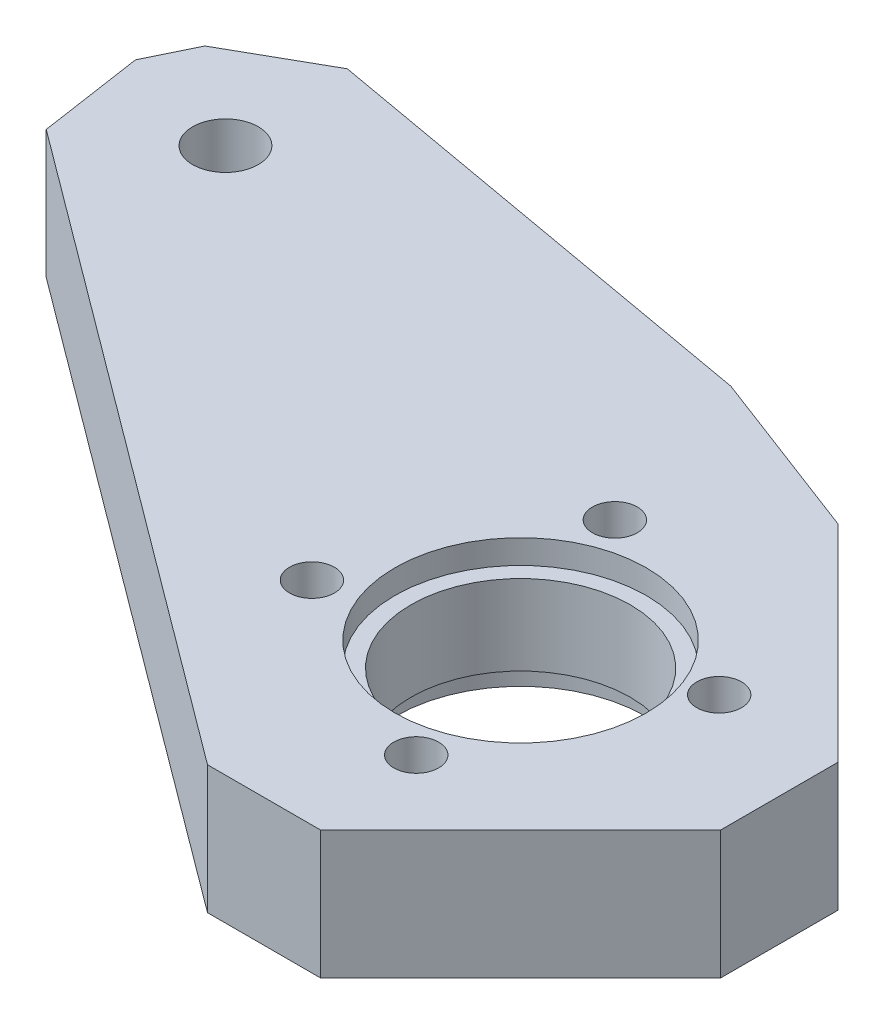
ISO-10303-21;
HEADER;
FILE_DESCRIPTION(('STEP AP214'),'2;1');
FILE_NAME('part.step','',(''),(''),'','','');
FILE_SCHEMA(('AUTOMOTIVE_DESIGN { 1 0 10303 214 1 1 1 1 }'));
ENDSEC;
DATA;
#1=APPLICATION_CONTEXT('core data for automotive mechanical design processes');
#2=APPLICATION_PROTOCOL_DEFINITION('international standard','automotive_design',2000,#1);
#3=PRODUCT_CONTEXT('',#1,'mechanical');
#4=PRODUCT('Part','Part','',(#3));
#5=PRODUCT_RELATED_PRODUCT_CATEGORY('part','',(#4));
#6=PRODUCT_DEFINITION_FORMATION('','',#4);
#7=PRODUCT_DEFINITION_CONTEXT('part definition',#1,'design');
#8=PRODUCT_DEFINITION('design','',#6,#7);
#9=PRODUCT_DEFINITION_SHAPE('','',#8);
#10=(LENGTH_UNIT() NAMED_UNIT(*) SI_UNIT(.MILLI.,.METRE.));
#11=(NAMED_UNIT(*) PLANE_ANGLE_UNIT() SI_UNIT($,.RADIAN.));
#12=(NAMED_UNIT(*) SI_UNIT($,.STERADIAN.) SOLID_ANGLE_UNIT());
#13=UNCERTAINTY_MEASURE_WITH_UNIT(LENGTH_MEASURE(1.E-05),#10,'distance_accuracy_value','');
#14=(GEOMETRIC_REPRESENTATION_CONTEXT(3) GLOBAL_UNCERTAINTY_ASSIGNED_CONTEXT((#13)) GLOBAL_UNIT_ASSIGNED_CONTEXT((#10,
#11,#12)) REPRESENTATION_CONTEXT('',''));
#15=CARTESIAN_POINT('',(0.,0.,0.));
#16=DIRECTION('',(0.,0.,1.));
#17=DIRECTION('',(1.,0.,0.));
#18=AXIS2_PLACEMENT_3D('',#15,#16,#17);
#19=CARTESIAN_POINT('',(-206.266697519,-37.000004703,299.965154128));
#20=DIRECTION('',(0.,-1.,0.));
#21=DIRECTION('',(0.,0.,-1.));
#22=AXIS2_PLACEMENT_3D('',#19,#20,#21);
#23=PLANE('',#22);
#24=CARTESIAN_POINT('',(100.000038384,-37.000004703,62.5));
#25=DIRECTION('',(0.,-1.,0.));
#26=DIRECTION('',(0.,0.,-1.));
#27=AXIS2_PLACEMENT_3D('',#24,#25,#26);
#28=CIRCLE('',#27,6.85);
#29=CARTESIAN_POINT('',(100.000038384,-37.000004703,55.65));
#30=VERTEX_POINT('',#29);
#31=CARTESIAN_POINT('',(93.150038384,-37.000004703,62.5));
#32=VERTEX_POINT('',#31);
#33=EDGE_CURVE('E342',#30,#32,#28,.T.);
#34=ORIENTED_EDGE('',*,*,#33,.T.);
#35=CARTESIAN_POINT('',(100.000038384,-37.000004703,62.5));
#36=DIRECTION('',(0.,-1.,0.));
#37=DIRECTION('',(0.,0.,-1.));
#38=AXIS2_PLACEMENT_3D('',#35,#36,#37);
#39=CIRCLE('',#38,6.85);
#40=EDGE_CURVE('E169',#32,#30,#39,.T.);
#41=ORIENTED_EDGE('',*,*,#40,.T.);
#42=EDGE_LOOP('',(#34,#41));
#43=FACE_BOUND('',#42,.T.);
#44=CARTESIAN_POINT('',(100.000038384,-37.000004703,62.5));
#45=DIRECTION('',(0.,-1.,0.));
#46=DIRECTION('',(0.,0.,-1.));
#47=AXIS2_PLACEMENT_3D('',#44,#45,#46);
#48=CIRCLE('',#47,7.85);
#49=CARTESIAN_POINT('',(92.150038384,-37.000004703,62.5));
#50=VERTEX_POINT('',#49);
#51=CARTESIAN_POINT('',(100.000038384,-37.000004703,54.65));
#52=VERTEX_POINT('',#51);
#53=EDGE_CURVE('E355',#50,#52,#48,.T.);
#54=ORIENTED_EDGE('',*,*,#53,.F.);
#55=CARTESIAN_POINT('',(100.000038384,-37.000004703,62.5));
#56=DIRECTION('',(0.,-1.,0.));
#57=DIRECTION('',(0.,0.,-1.));
#58=AXIS2_PLACEMENT_3D('',#55,#56,#57);
#59=CIRCLE('',#58,7.85);
#60=EDGE_CURVE('E352',#52,#50,#59,.T.);
#61=ORIENTED_EDGE('',*,*,#60,.F.);
#62=EDGE_LOOP('',(#54,#61));
#63=FACE_BOUND('',#62,.T.);
#64=ADVANCED_FACE('F92',(#43,#63),#23,.F.);
#65=CARTESIAN_POINT('',(-206.266697519,-42.000004703,299.965154128));
#66=DIRECTION('',(0.,-1.,0.));
#67=DIRECTION('',(0.,0.,-1.));
#68=AXIS2_PLACEMENT_3D('',#65,#66,#67);
#69=PLANE('',#68);
#70=CARTESIAN_POINT('',(100.000038384,-42.000004703,62.5));
#71=DIRECTION('',(0.,-1.,0.));
#72=DIRECTION('',(0.,0.,-1.));
#73=AXIS2_PLACEMENT_3D('',#70,#71,#72);
#74=CIRCLE('',#73,6.85);
#75=CARTESIAN_POINT('',(93.150038384,-42.000004703,62.5));
#76=VERTEX_POINT('',#75);
#77=CARTESIAN_POINT('',(100.000038384,-42.000004703,55.65));
#78=VERTEX_POINT('',#77);
#79=EDGE_CURVE('E96',#76,#78,#74,.T.);
#80=ORIENTED_EDGE('',*,*,#79,.F.);
#81=CARTESIAN_POINT('',(100.000038384,-42.000004703,62.5));
#82=DIRECTION('',(0.,-1.,0.));
#83=DIRECTION('',(0.,0.,-1.));
#84=AXIS2_PLACEMENT_3D('',#81,#82,#83);
#85=CIRCLE('',#84,6.85);
#86=EDGE_CURVE('E12',#78,#76,#85,.T.);
#87=ORIENTED_EDGE('',*,*,#86,.F.);
#88=EDGE_LOOP('',(#80,#87));
#89=FACE_BOUND('',#88,.T.);
#90=CARTESIAN_POINT('',(100.000038384,-42.000004703,62.5));
#91=DIRECTION('',(0.,-1.,0.));
#92=DIRECTION('',(0.,0.,-1.));
#93=AXIS2_PLACEMENT_3D('',#90,#91,#92);
#94=CIRCLE('',#93,7.8);
#95=CARTESIAN_POINT('',(100.000038384,-42.000004703,54.7));
#96=VERTEX_POINT('',#95);
#97=CARTESIAN_POINT('',(92.200038384,-42.000004703,62.5));
#98=VERTEX_POINT('',#97);
#99=EDGE_CURVE('E364',#96,#98,#94,.T.);
#100=ORIENTED_EDGE('',*,*,#99,.T.);
#101=CARTESIAN_POINT('',(100.000038384,-42.000004703,62.5));
#102=DIRECTION('',(0.,-1.,0.));
#103=DIRECTION('',(0.,0.,-1.));
#104=AXIS2_PLACEMENT_3D('',#101,#102,#103);
#105=CIRCLE('',#104,7.8);
#106=EDGE_CURVE('E362',#98,#96,#105,.T.);
#107=ORIENTED_EDGE('',*,*,#106,.T.);
#108=EDGE_LOOP('',(#100,#107));
#109=FACE_BOUND('',#108,.T.);
#110=ADVANCED_FACE('F452',(#89,#109),#69,.T.);
#111=CARTESIAN_POINT('',(100.000038384,-40.500004703,62.5));
#112=DIRECTION('',(0.,1.,0.));
#113=DIRECTION('',(-1.,0.,0.));
#114=AXIS2_PLACEMENT_3D('',#111,#112,#113);
#115=CYLINDRICAL_SURFACE('',#114,6.85);
#116=DIRECTION('',(0.,-1.,0.));
#117=VECTOR('',#116,1.);
#118=CARTESIAN_POINT('',(93.150038384,-37.000004703,62.5));
#119=LINE('',#118,#117);
#120=EDGE_CURVE('E344',#32,#76,#119,.T.);
#121=ORIENTED_EDGE('',*,*,#120,.F.);
#122=ORIENTED_EDGE('',*,*,#33,.F.);
#123=ORIENTED_EDGE('',*,*,#40,.F.);
#124=ORIENTED_EDGE('',*,*,#120,.T.);
#125=ORIENTED_EDGE('',*,*,#79,.T.);
#126=ORIENTED_EDGE('',*,*,#86,.T.);
#127=EDGE_LOOP('',(#121,#122,#123,#124,#125,#126));
#128=FACE_BOUND('',#127,.T.);
#129=ADVANCED_FACE('F454',(#128),#115,.F.);
#130=CARTESIAN_POINT('',(-206.266697519,-35.500004703,299.965154128));
#131=DIRECTION('',(0.,-1.,0.));
#132=DIRECTION('',(0.,0.,-1.));
#133=AXIS2_PLACEMENT_3D('',#130,#131,#132);
#134=PLANE('',#133);
#135=CARTESIAN_POINT('',(96.429382788,-35.500004703,53.044814244));
#136=DIRECTION('',(0.,-1.,0.));
#137=DIRECTION('',(1.,0.,0.));
#138=AXIS2_PLACEMENT_3D('',#135,#136,#137);
#139=CIRCLE('',#138,1.4);
#140=CARTESIAN_POINT('',(97.829382788,-35.500004703,53.044814244));
#141=VERTEX_POINT('',#140);
#142=CARTESIAN_POINT('',(95.029382788,-35.500004703,53.044814244));
#143=VERTEX_POINT('',#142);
#144=EDGE_CURVE('E348',#141,#143,#139,.T.);
#145=ORIENTED_EDGE('',*,*,#144,.T.);
#146=CARTESIAN_POINT('',(96.429382788,-35.500004703,53.044814244));
#147=DIRECTION('',(0.,-1.,0.));
#148=DIRECTION('',(1.,0.,0.));
#149=AXIS2_PLACEMENT_3D('',#146,#147,#148);
#150=CIRCLE('',#149,1.4);
#151=EDGE_CURVE('E351',#143,#141,#150,.T.);
#152=ORIENTED_EDGE('',*,*,#151,.T.);
#153=EDGE_LOOP('',(#145,#152));
#154=FACE_BOUND('',#153,.T.);
#155=CARTESIAN_POINT('',(102.940745878,-35.500004703,71.955185756));
#156=DIRECTION('',(0.,-1.,0.));
#157=DIRECTION('',(1.,0.,0.));
#158=AXIS2_PLACEMENT_3D('',#155,#156,#157);
#159=CIRCLE('',#158,1.4);
#160=CARTESIAN_POINT('',(104.340745878,-35.500004703,71.955185756));
#161=VERTEX_POINT('',#160);
#162=CARTESIAN_POINT('',(101.540745878,-35.500004703,71.955185756));
#163=VERTEX_POINT('',#162);
#164=EDGE_CURVE('E361',#161,#163,#159,.T.);
#165=ORIENTED_EDGE('',*,*,#164,.T.);
#166=CARTESIAN_POINT('',(102.940745878,-35.500004703,71.955185756));
#167=DIRECTION('',(0.,-1.,0.));
#168=DIRECTION('',(1.,0.,0.));
#169=AXIS2_PLACEMENT_3D('',#166,#167,#168);
#170=CIRCLE('',#169,1.4);
#171=EDGE_CURVE('E418',#163,#161,#170,.T.);
#172=ORIENTED_EDGE('',*,*,#171,.T.);
#173=EDGE_LOOP('',(#165,#172));
#174=FACE_BOUND('',#173,.T.);
#175=CARTESIAN_POINT('',(90.229878577,-35.500004703,65.755681545));
#176=DIRECTION('',(0.,-1.,0.));
#177=DIRECTION('',(1.,0.,0.));
#178=AXIS2_PLACEMENT_3D('',#175,#176,#177);
#179=CIRCLE('',#178,1.4);
#180=CARTESIAN_POINT('',(91.629878577,-35.500004703,65.755681545));
#181=VERTEX_POINT('',#180);
#182=CARTESIAN_POINT('',(88.829878577,-35.500004703,65.755681545));
#183=VERTEX_POINT('',#182);
#184=EDGE_CURVE('E365',#181,#183,#179,.T.);
#185=ORIENTED_EDGE('',*,*,#184,.T.);
#186=CARTESIAN_POINT('',(90.229878577,-35.500004703,65.755681545));
#187=DIRECTION('',(0.,-1.,0.));
#188=DIRECTION('',(1.,0.,0.));
#189=AXIS2_PLACEMENT_3D('',#186,#187,#188);
#190=CIRCLE('',#189,1.4);
#191=EDGE_CURVE('E340',#183,#181,#190,.T.);
#192=ORIENTED_EDGE('',*,*,#191,.T.);
#193=EDGE_LOOP('',(#185,#192));
#194=FACE_BOUND('',#193,.T.);
#195=CARTESIAN_POINT('',(64.046053168,-35.500004703,44.969712702));
#196=DIRECTION('',(0.,-1.,0.));
#197=DIRECTION('',(0.,0.,-1.));
#198=AXIS2_PLACEMENT_3D('',#195,#196,#197);
#199=CIRCLE('',#198,2.05);
#200=CARTESIAN_POINT('',(64.046053168,-35.500004703,42.919712702));
#201=VERTEX_POINT('',#200);
#202=CARTESIAN_POINT('',(61.996053168,-35.500004703,44.969712702));
#203=VERTEX_POINT('',#202);
#204=EDGE_CURVE('E347',#201,#203,#199,.T.);
#205=ORIENTED_EDGE('',*,*,#204,.T.);
#206=CARTESIAN_POINT('',(64.046053168,-35.500004703,44.969712702));
#207=DIRECTION('',(0.,-1.,0.));
#208=DIRECTION('',(0.,0.,-1.));
#209=AXIS2_PLACEMENT_3D('',#206,#207,#208);
#210=CIRCLE('',#209,2.05);
#211=EDGE_CURVE('E373',#203,#201,#210,.T.);
#212=ORIENTED_EDGE('',*,*,#211,.T.);
#213=EDGE_LOOP('',(#205,#212));
#214=FACE_BOUND('',#213,.T.);
#215=CARTESIAN_POINT('',(109.140250089,-35.500004703,59.244318455));
#216=DIRECTION('',(0.,-1.,0.));
#217=DIRECTION('',(1.,0.,0.));
#218=AXIS2_PLACEMENT_3D('',#215,#216,#217);
#219=CIRCLE('',#218,1.4);
#220=CARTESIAN_POINT('',(110.540250089,-35.500004703,59.244318455));
#221=VERTEX_POINT('',#220);
#222=CARTESIAN_POINT('',(107.740250089,-35.500004703,59.244318455));
#223=VERTEX_POINT('',#222);
#224=EDGE_CURVE('E385',#221,#223,#219,.T.);
#225=ORIENTED_EDGE('',*,*,#224,.T.);
#226=CARTESIAN_POINT('',(109.140250089,-35.500004703,59.244318455));
#227=DIRECTION('',(0.,-1.,0.));
#228=DIRECTION('',(1.,0.,0.));
#229=AXIS2_PLACEMENT_3D('',#226,#227,#228);
#230=CIRCLE('',#229,1.4);
#231=EDGE_CURVE('E387',#223,#221,#230,.T.);
#232=ORIENTED_EDGE('',*,*,#231,.T.);
#233=EDGE_LOOP('',(#225,#232));
#234=FACE_BOUND('',#233,.T.);
#235=CARTESIAN_POINT('',(100.000038384,-35.500004703,62.5));
#236=DIRECTION('',(0.,-1.,0.));
#237=DIRECTION('',(0.,0.,-1.));
#238=AXIS2_PLACEMENT_3D('',#235,#236,#237);
#239=CIRCLE('',#238,7.85);
#240=CARTESIAN_POINT('',(100.000038384,-35.500004703,54.65));
#241=VERTEX_POINT('',#240);
#242=CARTESIAN_POINT('',(92.150038384,-35.500004703,62.5));
#243=VERTEX_POINT('',#242);
#244=EDGE_CURVE('E369',#241,#243,#239,.T.);
#245=ORIENTED_EDGE('',*,*,#244,.T.);
#246=CARTESIAN_POINT('',(100.000038384,-35.500004703,62.5));
#247=DIRECTION('',(0.,-1.,0.));
#248=DIRECTION('',(0.,0.,-1.));
#249=AXIS2_PLACEMENT_3D('',#246,#247,#248);
#250=CIRCLE('',#249,7.85);
#251=EDGE_CURVE('E358',#243,#241,#250,.T.);
#252=ORIENTED_EDGE('',*,*,#251,.T.);
#253=EDGE_LOOP('',(#245,#252));
#254=FACE_BOUND('',#253,.T.);
#255=DIRECTION('',(-0.870211440463982,0.,0.492678443698931));
#256=VECTOR('',#255,1.);
#257=CARTESIAN_POINT('',(63.6897348581457,-35.500004703,37.0094723415916));
#258=LINE('',#257,#256);
#259=CARTESIAN_POINT('',(63.6897348581457,-35.500004703,37.0094723415916));
#260=VERTEX_POINT('',#259);
#261=CARTESIAN_POINT('',(58.0177872912911,-35.500004703,40.2206991423907));
#262=VERTEX_POINT('',#261);
#263=EDGE_CURVE('E284',#260,#262,#258,.T.);
#264=ORIENTED_EDGE('',*,*,#263,.T.);
#265=DIRECTION('',(-0.438371147077342,0.,0.898794046158571));
#266=VECTOR('',#265,1.);
#267=CARTESIAN_POINT('',(58.0177872912911,-35.500004703,40.2206991423907));
#268=LINE('',#267,#266);
#269=CARTESIAN_POINT('',(56.5968550797981,-35.500004703,43.134041911867));
#270=VERTEX_POINT('',#269);
#271=EDGE_CURVE('E501',#262,#270,#268,.T.);
#272=ORIENTED_EDGE('',*,*,#271,.T.);
#273=DIRECTION('',(0.147519747511098,0.,0.989059110515778));
#274=VECTOR('',#273,1.);
#275=CARTESIAN_POINT('',(56.5968550797981,-35.500004703,43.134041911867));
#276=LINE('',#275,#274);
#277=CARTESIAN_POINT('',(57.5738866518634,-35.500004703,49.6846359436255));
#278=VERTEX_POINT('',#277);
#279=EDGE_CURVE('E280',#270,#278,#276,.T.);
#280=ORIENTED_EDGE('',*,*,#279,.T.);
#281=DIRECTION('',(0.802173464510192,0.,0.597091059082043));
#282=VECTOR('',#281,1.);
#283=CARTESIAN_POINT('',(57.5738866518634,-35.500004703,49.6846359436255));
#284=LINE('',#283,#282);
#285=CARTESIAN_POINT('',(96.9523845078725,-35.500004703,78.995689014));
#286=VERTEX_POINT('',#285);
#287=EDGE_CURVE('E506',#278,#286,#284,.T.);
#288=ORIENTED_EDGE('',*,*,#287,.T.);
#289=DIRECTION('',(1.,0.,0.));
#290=VECTOR('',#289,1.);
#291=CARTESIAN_POINT('',(96.9523845078725,-35.500004703,78.995689014));
#292=LINE('',#291,#290);
#293=CARTESIAN_POINT('',(104.010446024746,-35.500004703,78.995689014));
#294=VERTEX_POINT('',#293);
#295=EDGE_CURVE('E511',#286,#294,#292,.T.);
#296=ORIENTED_EDGE('',*,*,#295,.T.);
#297=DIRECTION('',(0.707106781186548,0.,-0.707106781186548));
#298=VECTOR('',#297,1.);
#299=CARTESIAN_POINT('',(104.010446024746,-35.500004703,78.995689014));
#300=LINE('',#299,#298);
#301=CARTESIAN_POINT('',(116.495727399,-35.500004703,66.5104076397462));
#302=VERTEX_POINT('',#301);
#303=EDGE_CURVE('E514',#294,#302,#300,.T.);
#304=ORIENTED_EDGE('',*,*,#303,.T.);
#305=DIRECTION('',(0.,0.,-1.));
#306=VECTOR('',#305,1.);
#307=CARTESIAN_POINT('',(116.495727399,-35.500004703,66.5104076397462));
#308=LINE('',#307,#306);
#309=CARTESIAN_POINT('',(116.495727399,-35.500004703,59.1966991412538));
#310=VERTEX_POINT('',#309);
#311=EDGE_CURVE('E517',#302,#310,#308,.T.);
#312=ORIENTED_EDGE('',*,*,#311,.T.);
#313=DIRECTION('',(-0.707106781186548,0.,-0.707106781186547));
#314=VECTOR('',#313,1.);
#315=CARTESIAN_POINT('',(116.495727399,-35.500004703,59.1966991412538));
#316=LINE('',#315,#314);
#317=CARTESIAN_POINT('',(103.586027530498,-35.500004703,46.2869992727514));
#318=VERTEX_POINT('',#317);
#319=EDGE_CURVE('E520',#310,#318,#316,.T.);
#320=ORIENTED_EDGE('',*,*,#319,.T.);
#321=DIRECTION('',(-0.934785835128812,0.,-0.35521182756565));
#322=VECTOR('',#321,1.);
#323=CARTESIAN_POINT('',(103.586027530498,-35.500004703,46.2869992727514));
#324=LINE('',#323,#322);
#325=CARTESIAN_POINT('',(92.822153420475,-35.500004703,42.1968052939553));
#326=VERTEX_POINT('',#325);
#327=EDGE_CURVE('E523',#318,#326,#324,.T.);
#328=ORIENTED_EDGE('',*,*,#327,.T.);
#329=DIRECTION('',(-0.984514503788386,0.,-0.17530314267094));
#330=VECTOR('',#329,1.);
#331=CARTESIAN_POINT('',(92.822153420475,-35.500004703,42.1968052939553));
#332=LINE('',#331,#330);
#333=EDGE_CURVE('E395',#326,#260,#332,.T.);
#334=ORIENTED_EDGE('',*,*,#333,.T.);
#335=EDGE_LOOP('',(#264,#272,#280,#288,#296,#304,#312,#320,#328,#334));
#336=FACE_BOUND('',#335,.T.);
#337=ADVANCED_FACE('F429',(#154,#174,#194,#214,#234,#254,#336),#134,.F.);
#338=CARTESIAN_POINT('',(-206.266697519,-43.500004703,299.965154128));
#339=DIRECTION('',(0.,-1.,0.));
#340=DIRECTION('',(0.,0.,-1.));
#341=AXIS2_PLACEMENT_3D('',#338,#339,#340);
#342=PLANE('',#341);
#343=CARTESIAN_POINT('',(96.429382788,-43.500004703,53.044814244));
#344=DIRECTION('',(0.,-1.,0.));
#345=DIRECTION('',(0.,0.,-1.));
#346=AXIS2_PLACEMENT_3D('',#343,#344,#345);
#347=CIRCLE('',#346,1.4);
#348=CARTESIAN_POINT('',(95.029382788,-43.500004703,53.044814244));
#349=VERTEX_POINT('',#348);
#350=CARTESIAN_POINT('',(96.429382788,-43.500004703,51.644814244));
#351=VERTEX_POINT('',#350);
#352=EDGE_CURVE('E384',#349,#351,#347,.T.);
#353=ORIENTED_EDGE('',*,*,#352,.F.);
#354=CARTESIAN_POINT('',(96.429382788,-43.500004703,53.044814244));
#355=DIRECTION('',(0.,-1.,0.));
#356=DIRECTION('',(0.,0.,-1.));
#357=AXIS2_PLACEMENT_3D('',#354,#355,#356);
#358=CIRCLE('',#357,1.4);
#359=EDGE_CURVE('E396',#351,#349,#358,.T.);
#360=ORIENTED_EDGE('',*,*,#359,.F.);
#361=EDGE_LOOP('',(#353,#360));
#362=FACE_BOUND('',#361,.T.);
#363=CARTESIAN_POINT('',(102.940745878,-43.500004703,71.955185756));
#364=DIRECTION('',(0.,-1.,0.));
#365=DIRECTION('',(0.,0.,-1.));
#366=AXIS2_PLACEMENT_3D('',#363,#364,#365);
#367=CIRCLE('',#366,1.4);
#368=CARTESIAN_POINT('',(101.540745878,-43.500004703,71.955185756));
#369=VERTEX_POINT('',#368);
#370=CARTESIAN_POINT('',(102.940745878,-43.500004703,70.555185756));
#371=VERTEX_POINT('',#370);
#372=EDGE_CURVE('E408',#369,#371,#367,.T.);
#373=ORIENTED_EDGE('',*,*,#372,.F.);
#374=CARTESIAN_POINT('',(102.940745878,-43.500004703,71.955185756));
#375=DIRECTION('',(0.,-1.,0.));
#376=DIRECTION('',(0.,0.,-1.));
#377=AXIS2_PLACEMENT_3D('',#374,#375,#376);
#378=CIRCLE('',#377,1.4);
#379=EDGE_CURVE('E382',#371,#369,#378,.T.);
#380=ORIENTED_EDGE('',*,*,#379,.F.);
#381=EDGE_LOOP('',(#373,#380));
#382=FACE_BOUND('',#381,.T.);
#383=CARTESIAN_POINT('',(90.229878577,-43.500004703,65.755681545));
#384=DIRECTION('',(0.,-1.,0.));
#385=DIRECTION('',(0.,0.,-1.));
#386=AXIS2_PLACEMENT_3D('',#383,#384,#385);
#387=CIRCLE('',#386,1.4);
#388=CARTESIAN_POINT('',(88.829878577,-43.500004703,65.755681545));
#389=VERTEX_POINT('',#388);
#390=CARTESIAN_POINT('',(90.229878577,-43.500004703,64.355681545));
#391=VERTEX_POINT('',#390);
#392=EDGE_CURVE('E332',#389,#391,#387,.T.);
#393=ORIENTED_EDGE('',*,*,#392,.F.);
#394=CARTESIAN_POINT('',(90.229878577,-43.500004703,65.755681545));
#395=DIRECTION('',(0.,-1.,0.));
#396=DIRECTION('',(0.,0.,-1.));
#397=AXIS2_PLACEMENT_3D('',#394,#395,#396);
#398=CIRCLE('',#397,1.4);
#399=EDGE_CURVE('E329',#391,#389,#398,.T.);
#400=ORIENTED_EDGE('',*,*,#399,.F.);
#401=EDGE_LOOP('',(#393,#400));
#402=FACE_BOUND('',#401,.T.);
#403=CARTESIAN_POINT('',(64.046053168,-43.500004703,44.969712702));
#404=DIRECTION('',(0.,-1.,0.));
#405=DIRECTION('',(0.,0.,-1.));
#406=AXIS2_PLACEMENT_3D('',#403,#404,#405);
#407=CIRCLE('',#406,2.05);
#408=CARTESIAN_POINT('',(61.996053168,-43.500004703,44.969712702));
#409=VERTEX_POINT('',#408);
#410=CARTESIAN_POINT('',(64.046053168,-43.500004703,42.919712702));
#411=VERTEX_POINT('',#410);
#412=EDGE_CURVE('E375',#409,#411,#407,.T.);
#413=ORIENTED_EDGE('',*,*,#412,.F.);
#414=CARTESIAN_POINT('',(64.046053168,-43.500004703,44.969712702));
#415=DIRECTION('',(0.,-1.,0.));
#416=DIRECTION('',(0.,0.,-1.));
#417=AXIS2_PLACEMENT_3D('',#414,#415,#416);
#418=CIRCLE('',#417,2.05);
#419=EDGE_CURVE('E392',#411,#409,#418,.T.);
#420=ORIENTED_EDGE('',*,*,#419,.F.);
#421=EDGE_LOOP('',(#413,#420));
#422=FACE_BOUND('',#421,.T.);
#423=CARTESIAN_POINT('',(109.140250089,-43.500004703,59.244318455));
#424=DIRECTION('',(0.,-1.,0.));
#425=DIRECTION('',(0.,0.,-1.));
#426=AXIS2_PLACEMENT_3D('',#423,#424,#425);
#427=CIRCLE('',#426,1.4);
#428=CARTESIAN_POINT('',(107.740250089,-43.500004703,59.244318455));
#429=VERTEX_POINT('',#428);
#430=CARTESIAN_POINT('',(109.140250089,-43.500004703,57.844318455));
#431=VERTEX_POINT('',#430);
#432=EDGE_CURVE('E401',#429,#431,#427,.T.);
#433=ORIENTED_EDGE('',*,*,#432,.F.);
#434=CARTESIAN_POINT('',(109.140250089,-43.500004703,59.244318455));
#435=DIRECTION('',(0.,-1.,0.));
#436=DIRECTION('',(0.,0.,-1.));
#437=AXIS2_PLACEMENT_3D('',#434,#435,#436);
#438=CIRCLE('',#437,1.4);
#439=EDGE_CURVE('E379',#431,#429,#438,.T.);
#440=ORIENTED_EDGE('',*,*,#439,.F.);
#441=EDGE_LOOP('',(#433,#440));
#442=FACE_BOUND('',#441,.T.);
#443=CARTESIAN_POINT('',(100.000038384,-43.500004703,62.5));
#444=DIRECTION('',(0.,-1.,0.));
#445=DIRECTION('',(0.,0.,-1.));
#446=AXIS2_PLACEMENT_3D('',#443,#444,#445);
#447=CIRCLE('',#446,7.8);
#448=CARTESIAN_POINT('',(92.200038384,-43.500004703,62.5));
#449=VERTEX_POINT('',#448);
#450=CARTESIAN_POINT('',(100.000038384,-43.500004703,54.7));
#451=VERTEX_POINT('',#450);
#452=EDGE_CURVE('E337',#449,#451,#447,.T.);
#453=ORIENTED_EDGE('',*,*,#452,.F.);
#454=CARTESIAN_POINT('',(100.000038384,-43.500004703,62.5));
#455=DIRECTION('',(0.,-1.,0.));
#456=DIRECTION('',(0.,0.,-1.));
#457=AXIS2_PLACEMENT_3D('',#454,#455,#456);
#458=CIRCLE('',#457,7.8);
#459=EDGE_CURVE('E333',#451,#449,#458,.T.);
#460=ORIENTED_EDGE('',*,*,#459,.F.);
#461=EDGE_LOOP('',(#453,#460));
#462=FACE_BOUND('',#461,.T.);
#463=DIRECTION('',(-0.870211440463982,0.,0.492678443698932));
#464=VECTOR('',#463,1.);
#465=CARTESIAN_POINT('',(63.6897348581457,-43.500004703,37.0094723415916));
#466=LINE('',#465,#464);
#467=CARTESIAN_POINT('',(63.6897348581457,-43.500004703,37.0094723415916));
#468=VERTEX_POINT('',#467);
#469=CARTESIAN_POINT('',(58.0177872912911,-43.500004703,40.2206991423907));
#470=VERTEX_POINT('',#469);
#471=EDGE_CURVE('E294',#468,#470,#466,.T.);
#472=ORIENTED_EDGE('',*,*,#471,.F.);
#473=DIRECTION('',(-0.984514503788386,0.,-0.17530314267094));
#474=VECTOR('',#473,1.);
#475=CARTESIAN_POINT('',(92.822153420475,-43.500004703,42.1968052939553));
#476=LINE('',#475,#474);
#477=CARTESIAN_POINT('',(92.822153420475,-43.500004703,42.1968052939553));
#478=VERTEX_POINT('',#477);
#479=EDGE_CURVE('E296',#478,#468,#476,.T.);
#480=ORIENTED_EDGE('',*,*,#479,.F.);
#481=DIRECTION('',(-0.934785835128812,0.,-0.35521182756565));
#482=VECTOR('',#481,1.);
#483=CARTESIAN_POINT('',(103.586027530498,-43.500004703,46.2869992727514));
#484=LINE('',#483,#482);
#485=CARTESIAN_POINT('',(103.586027530498,-43.500004703,46.2869992727514));
#486=VERTEX_POINT('',#485);
#487=EDGE_CURVE('E300',#486,#478,#484,.T.);
#488=ORIENTED_EDGE('',*,*,#487,.F.);
#489=DIRECTION('',(-0.707106781186548,0.,-0.707106781186547));
#490=VECTOR('',#489,1.);
#491=CARTESIAN_POINT('',(116.495727399,-43.500004703,59.1966991412538));
#492=LINE('',#491,#490);
#493=CARTESIAN_POINT('',(116.495727399,-43.500004703,59.1966991412538));
#494=VERTEX_POINT('',#493);
#495=EDGE_CURVE('E304',#494,#486,#492,.T.);
#496=ORIENTED_EDGE('',*,*,#495,.F.);
#497=DIRECTION('',(0.,0.,-1.));
#498=VECTOR('',#497,1.);
#499=CARTESIAN_POINT('',(116.495727399,-43.500004703,66.5104076397462));
#500=LINE('',#499,#498);
#501=CARTESIAN_POINT('',(116.495727399,-43.500004703,66.5104076397462));
#502=VERTEX_POINT('',#501);
#503=EDGE_CURVE('E308',#502,#494,#500,.T.);
#504=ORIENTED_EDGE('',*,*,#503,.F.);
#505=DIRECTION('',(0.707106781186548,0.,-0.707106781186548));
#506=VECTOR('',#505,1.);
#507=CARTESIAN_POINT('',(104.010446024746,-43.500004703,78.995689014));
#508=LINE('',#507,#506);
#509=CARTESIAN_POINT('',(104.010446024746,-43.500004703,78.995689014));
#510=VERTEX_POINT('',#509);
#511=EDGE_CURVE('E312',#510,#502,#508,.T.);
#512=ORIENTED_EDGE('',*,*,#511,.F.);
#513=DIRECTION('',(1.,0.,0.));
#514=VECTOR('',#513,1.);
#515=CARTESIAN_POINT('',(96.9523845078725,-43.500004703,78.995689014));
#516=LINE('',#515,#514);
#517=CARTESIAN_POINT('',(96.9523845078725,-43.500004703,78.995689014));
#518=VERTEX_POINT('',#517);
#519=EDGE_CURVE('E316',#518,#510,#516,.T.);
#520=ORIENTED_EDGE('',*,*,#519,.F.);
#521=DIRECTION('',(0.802173464510192,0.,0.597091059082043));
#522=VECTOR('',#521,1.);
#523=CARTESIAN_POINT('',(57.5738866518634,-43.500004703,49.6846359436255));
#524=LINE('',#523,#522);
#525=CARTESIAN_POINT('',(57.5738866518634,-43.500004703,49.6846359436255));
#526=VERTEX_POINT('',#525);
#527=EDGE_CURVE('E270',#526,#518,#524,.T.);
#528=ORIENTED_EDGE('',*,*,#527,.F.);
#529=DIRECTION('',(0.147519747511098,0.,0.989059110515778));
#530=VECTOR('',#529,1.);
#531=CARTESIAN_POINT('',(56.5968550797981,-43.500004703,43.134041911867));
#532=LINE('',#531,#530);
#533=CARTESIAN_POINT('',(56.5968550797981,-43.500004703,43.134041911867));
#534=VERTEX_POINT('',#533);
#535=EDGE_CURVE('E263',#534,#526,#532,.T.);
#536=ORIENTED_EDGE('',*,*,#535,.F.);
#537=DIRECTION('',(-0.438371147077342,0.,0.898794046158571));
#538=VECTOR('',#537,1.);
#539=CARTESIAN_POINT('',(58.0177872912911,-43.500004703,40.2206991423907));
#540=LINE('',#539,#538);
#541=EDGE_CURVE('E267',#470,#534,#540,.T.);
#542=ORIENTED_EDGE('',*,*,#541,.F.);
#543=EDGE_LOOP('',(#472,#480,#488,#496,#504,#512,#520,#528,#536,#542));
#544=FACE_BOUND('',#543,.T.);
#545=ADVANCED_FACE('F265',(#362,#382,#402,#422,#442,#462,#544),#342,.T.);
#546=CARTESIAN_POINT('',(96.429382788,-41.500004703,53.044814244));
#547=DIRECTION('',(0.,1.,0.));
#548=DIRECTION('',(-1.,0.,0.));
#549=AXIS2_PLACEMENT_3D('',#546,#547,#548);
#550=CYLINDRICAL_SURFACE('',#549,1.4);
#551=DIRECTION('',(0.,-1.,0.));
#552=VECTOR('',#551,1.);
#553=CARTESIAN_POINT('',(95.029382788,-35.500004703,53.044814244));
#554=LINE('',#553,#552);
#555=EDGE_CURVE('E336',#143,#349,#554,.T.);
#556=ORIENTED_EDGE('',*,*,#555,.F.);
#557=ORIENTED_EDGE('',*,*,#144,.F.);
#558=ORIENTED_EDGE('',*,*,#151,.F.);
#559=ORIENTED_EDGE('',*,*,#555,.T.);
#560=ORIENTED_EDGE('',*,*,#352,.T.);
#561=ORIENTED_EDGE('',*,*,#359,.T.);
#562=EDGE_LOOP('',(#556,#557,#558,#559,#560,#561));
#563=FACE_BOUND('',#562,.T.);
#564=ADVANCED_FACE('F437',(#563),#550,.F.);
#565=CARTESIAN_POINT('',(100.000038384,-41.500004703,62.5));
#566=DIRECTION('',(0.,1.,0.));
#567=DIRECTION('',(-1.,0.,0.));
#568=AXIS2_PLACEMENT_3D('',#565,#566,#567);
#569=CYLINDRICAL_SURFACE('',#568,7.8);
#570=DIRECTION('',(0.,-1.,0.));
#571=VECTOR('',#570,1.);
#572=CARTESIAN_POINT('',(92.200038384,-42.000004703,62.5));
#573=LINE('',#572,#571);
#574=EDGE_CURVE('E376',#98,#449,#573,.T.);
#575=ORIENTED_EDGE('',*,*,#574,.F.);
#576=ORIENTED_EDGE('',*,*,#99,.F.);
#577=ORIENTED_EDGE('',*,*,#106,.F.);
#578=ORIENTED_EDGE('',*,*,#574,.T.);
#579=ORIENTED_EDGE('',*,*,#452,.T.);
#580=ORIENTED_EDGE('',*,*,#459,.T.);
#581=EDGE_LOOP('',(#575,#576,#577,#578,#579,#580));
#582=FACE_BOUND('',#581,.T.);
#583=ADVANCED_FACE('F449',(#582),#569,.F.);
#584=CARTESIAN_POINT('',(109.140250089,-41.500004703,59.244318455));
#585=DIRECTION('',(0.,1.,0.));
#586=DIRECTION('',(-1.,0.,0.));
#587=AXIS2_PLACEMENT_3D('',#584,#585,#586);
#588=CYLINDRICAL_SURFACE('',#587,1.4);
#589=DIRECTION('',(0.,-1.,0.));
#590=VECTOR('',#589,1.);
#591=CARTESIAN_POINT('',(107.740250089,-35.500004703,59.244318455));
#592=LINE('',#591,#590);
#593=EDGE_CURVE('E388',#223,#429,#592,.T.);
#594=ORIENTED_EDGE('',*,*,#593,.F.);
#595=ORIENTED_EDGE('',*,*,#224,.F.);
#596=ORIENTED_EDGE('',*,*,#231,.F.);
#597=ORIENTED_EDGE('',*,*,#593,.T.);
#598=ORIENTED_EDGE('',*,*,#432,.T.);
#599=ORIENTED_EDGE('',*,*,#439,.T.);
#600=EDGE_LOOP('',(#594,#595,#596,#597,#598,#599));
#601=FACE_BOUND('',#600,.T.);
#602=ADVANCED_FACE('F466',(#601),#588,.F.);
#603=CARTESIAN_POINT('',(64.046053168,-41.500004703,44.969712702));
#604=DIRECTION('',(0.,1.,0.));
#605=DIRECTION('',(-1.,0.,0.));
#606=AXIS2_PLACEMENT_3D('',#603,#604,#605);
#607=CYLINDRICAL_SURFACE('',#606,2.05);
#608=DIRECTION('',(0.,-1.,0.));
#609=VECTOR('',#608,1.);
#610=CARTESIAN_POINT('',(61.996053168,-35.500004703,44.969712702));
#611=LINE('',#610,#609);
#612=EDGE_CURVE('E331',#203,#409,#611,.T.);
#613=ORIENTED_EDGE('',*,*,#612,.F.);
#614=ORIENTED_EDGE('',*,*,#204,.F.);
#615=ORIENTED_EDGE('',*,*,#211,.F.);
#616=ORIENTED_EDGE('',*,*,#612,.T.);
#617=ORIENTED_EDGE('',*,*,#412,.T.);
#618=ORIENTED_EDGE('',*,*,#419,.T.);
#619=EDGE_LOOP('',(#613,#614,#615,#616,#617,#618));
#620=FACE_BOUND('',#619,.T.);
#621=ADVANCED_FACE('F94',(#620),#607,.F.);
#622=CARTESIAN_POINT('',(90.229878577,-41.500004703,65.755681545));
#623=DIRECTION('',(0.,1.,0.));
#624=DIRECTION('',(-1.,0.,0.));
#625=AXIS2_PLACEMENT_3D('',#622,#623,#624);
#626=CYLINDRICAL_SURFACE('',#625,1.4);
#627=DIRECTION('',(0.,-1.,0.));
#628=VECTOR('',#627,1.);
#629=CARTESIAN_POINT('',(88.829878577,-35.500004703,65.755681545));
#630=LINE('',#629,#628);
#631=EDGE_CURVE('E368',#183,#389,#630,.T.);
#632=ORIENTED_EDGE('',*,*,#631,.F.);
#633=ORIENTED_EDGE('',*,*,#184,.F.);
#634=ORIENTED_EDGE('',*,*,#191,.F.);
#635=ORIENTED_EDGE('',*,*,#631,.T.);
#636=ORIENTED_EDGE('',*,*,#392,.T.);
#637=ORIENTED_EDGE('',*,*,#399,.T.);
#638=EDGE_LOOP('',(#632,#633,#634,#635,#636,#637));
#639=FACE_BOUND('',#638,.T.);
#640=ADVANCED_FACE('F474',(#639),#626,.F.);
#641=CARTESIAN_POINT('',(102.940745878,-41.500004703,71.955185756));
#642=DIRECTION('',(0.,1.,0.));
#643=DIRECTION('',(-1.,0.,0.));
#644=AXIS2_PLACEMENT_3D('',#641,#642,#643);
#645=CYLINDRICAL_SURFACE('',#644,1.4);
#646=DIRECTION('',(0.,-1.,0.));
#647=VECTOR('',#646,1.);
#648=CARTESIAN_POINT('',(101.540745878,-35.500004703,71.955185756));
#649=LINE('',#648,#647);
#650=EDGE_CURVE('E354',#163,#369,#649,.T.);
#651=ORIENTED_EDGE('',*,*,#650,.F.);
#652=ORIENTED_EDGE('',*,*,#164,.F.);
#653=ORIENTED_EDGE('',*,*,#171,.F.);
#654=ORIENTED_EDGE('',*,*,#650,.T.);
#655=ORIENTED_EDGE('',*,*,#372,.T.);
#656=ORIENTED_EDGE('',*,*,#379,.T.);
#657=EDGE_LOOP('',(#651,#652,#653,#654,#655,#656));
#658=FACE_BOUND('',#657,.T.);
#659=ADVANCED_FACE('F432',(#658),#645,.F.);
#660=CARTESIAN_POINT('',(100.000038384,-41.500004703,62.5));
#661=DIRECTION('',(0.,1.,0.));
#662=DIRECTION('',(-1.,0.,0.));
#663=AXIS2_PLACEMENT_3D('',#660,#661,#662);
#664=CYLINDRICAL_SURFACE('',#663,7.85);
#665=DIRECTION('',(0.,-1.,0.));
#666=VECTOR('',#665,1.);
#667=CARTESIAN_POINT('',(92.150038384,-35.500004703,62.5));
#668=LINE('',#667,#666);
#669=EDGE_CURVE('E372',#243,#50,#668,.T.);
#670=ORIENTED_EDGE('',*,*,#669,.F.);
#671=ORIENTED_EDGE('',*,*,#244,.F.);
#672=ORIENTED_EDGE('',*,*,#251,.F.);
#673=ORIENTED_EDGE('',*,*,#669,.T.);
#674=ORIENTED_EDGE('',*,*,#53,.T.);
#675=ORIENTED_EDGE('',*,*,#60,.T.);
#676=EDGE_LOOP('',(#670,#671,#672,#673,#674,#675));
#677=FACE_BOUND('',#676,.T.);
#678=ADVANCED_FACE('F470',(#677),#664,.F.);
#679=CARTESIAN_POINT('',(63.6897348581457,-116.6486020619,37.0094723415916));
#680=DIRECTION('',(-0.492678443698932,0.,-0.870211440463982));
#681=DIRECTION('',(-0.870211440463982,0.,0.492678443698932));
#682=AXIS2_PLACEMENT_3D('',#679,#680,#681);
#683=PLANE('',#682);
#684=DIRECTION('',(0.,1.,0.));
#685=VECTOR('',#684,1.);
#686=CARTESIAN_POINT('',(63.6897348581457,-116.6486020619,37.0094723415916));
#687=LINE('',#686,#685);
#688=EDGE_CURVE('E299',#468,#260,#687,.T.);
#689=ORIENTED_EDGE('',*,*,#688,.F.);
#690=ORIENTED_EDGE('',*,*,#471,.T.);
#691=DIRECTION('',(0.,1.,0.));
#692=VECTOR('',#691,1.);
#693=CARTESIAN_POINT('',(58.0177872912911,-116.6486020619,40.2206991423907));
#694=LINE('',#693,#692);
#695=EDGE_CURVE('E288',#470,#262,#694,.T.);
#696=ORIENTED_EDGE('',*,*,#695,.T.);
#697=ORIENTED_EDGE('',*,*,#263,.F.);
#698=EDGE_LOOP('',(#689,#690,#696,#697));
#699=FACE_BOUND('',#698,.T.);
#700=ADVANCED_FACE('F472',(#699),#683,.T.);
#701=CARTESIAN_POINT('',(92.822153420475,-116.6486020619,42.1968052939553));
#702=DIRECTION('',(0.17530314267094,0.,-0.984514503788386));
#703=DIRECTION('',(-0.984514503788386,0.,-0.17530314267094));
#704=AXIS2_PLACEMENT_3D('',#701,#702,#703);
#705=PLANE('',#704);
#706=DIRECTION('',(0.,1.,0.));
#707=VECTOR('',#706,1.);
#708=CARTESIAN_POINT('',(92.822153420475,-116.6486020619,42.1968052939553));
#709=LINE('',#708,#707);
#710=EDGE_CURVE('E303',#478,#326,#709,.T.);
#711=ORIENTED_EDGE('',*,*,#710,.F.);
#712=ORIENTED_EDGE('',*,*,#479,.T.);
#713=ORIENTED_EDGE('',*,*,#688,.T.);
#714=ORIENTED_EDGE('',*,*,#333,.F.);
#715=EDGE_LOOP('',(#711,#712,#713,#714));
#716=FACE_BOUND('',#715,.T.);
#717=ADVANCED_FACE('F531',(#716),#705,.T.);
#718=CARTESIAN_POINT('',(103.586027530498,-116.6486020619,46.2869992727514));
#719=DIRECTION('',(0.35521182756565,0.,-0.934785835128812));
#720=DIRECTION('',(-0.934785835128812,0.,-0.35521182756565));
#721=AXIS2_PLACEMENT_3D('',#718,#719,#720);
#722=PLANE('',#721);
#723=DIRECTION('',(0.,1.,0.));
#724=VECTOR('',#723,1.);
#725=CARTESIAN_POINT('',(103.586027530498,-116.6486020619,46.2869992727514));
#726=LINE('',#725,#724);
#727=EDGE_CURVE('E307',#486,#318,#726,.T.);
#728=ORIENTED_EDGE('',*,*,#727,.F.);
#729=ORIENTED_EDGE('',*,*,#487,.T.);
#730=ORIENTED_EDGE('',*,*,#710,.T.);
#731=ORIENTED_EDGE('',*,*,#327,.F.);
#732=EDGE_LOOP('',(#728,#729,#730,#731));
#733=FACE_BOUND('',#732,.T.);
#734=ADVANCED_FACE('F533',(#733),#722,.T.);
#735=CARTESIAN_POINT('',(116.495727399,-116.6486020619,59.1966991412538));
#736=DIRECTION('',(0.707106781186547,0.,-0.707106781186548));
#737=DIRECTION('',(-0.707106781186548,0.,-0.707106781186547));
#738=AXIS2_PLACEMENT_3D('',#735,#736,#737);
#739=PLANE('',#738);
#740=DIRECTION('',(0.,1.,0.));
#741=VECTOR('',#740,1.);
#742=CARTESIAN_POINT('',(116.495727399,-116.6486020619,59.1966991412538));
#743=LINE('',#742,#741);
#744=EDGE_CURVE('E311',#494,#310,#743,.T.);
#745=ORIENTED_EDGE('',*,*,#744,.F.);
#746=ORIENTED_EDGE('',*,*,#495,.T.);
#747=ORIENTED_EDGE('',*,*,#727,.T.);
#748=ORIENTED_EDGE('',*,*,#319,.F.);
#749=EDGE_LOOP('',(#745,#746,#747,#748));
#750=FACE_BOUND('',#749,.T.);
#751=ADVANCED_FACE('F535',(#750),#739,.T.);
#752=CARTESIAN_POINT('',(116.495727399,-116.6486020619,66.5104076397462));
#753=DIRECTION('',(1.,0.,0.));
#754=DIRECTION('',(0.,0.,-1.));
#755=AXIS2_PLACEMENT_3D('',#752,#753,#754);
#756=PLANE('',#755);
#757=DIRECTION('',(0.,1.,0.));
#758=VECTOR('',#757,1.);
#759=CARTESIAN_POINT('',(116.495727399,-116.6486020619,66.5104076397462));
#760=LINE('',#759,#758);
#761=EDGE_CURVE('E315',#502,#302,#760,.T.);
#762=ORIENTED_EDGE('',*,*,#761,.F.);
#763=ORIENTED_EDGE('',*,*,#503,.T.);
#764=ORIENTED_EDGE('',*,*,#744,.T.);
#765=ORIENTED_EDGE('',*,*,#311,.F.);
#766=EDGE_LOOP('',(#762,#763,#764,#765));
#767=FACE_BOUND('',#766,.T.);
#768=ADVANCED_FACE('F539',(#767),#756,.T.);
#769=CARTESIAN_POINT('',(104.010446024746,-116.6486020619,78.995689014));
#770=DIRECTION('',(0.707106781186547,0.,0.707106781186547));
#771=DIRECTION('',(0.707106781186548,0.,-0.707106781186548));
#772=AXIS2_PLACEMENT_3D('',#769,#770,#771);
#773=PLANE('',#772);
#774=DIRECTION('',(0.,1.,0.));
#775=VECTOR('',#774,1.);
#776=CARTESIAN_POINT('',(104.010446024746,-116.6486020619,78.995689014));
#777=LINE('',#776,#775);
#778=EDGE_CURVE('E319',#510,#294,#777,.T.);
#779=ORIENTED_EDGE('',*,*,#778,.F.);
#780=ORIENTED_EDGE('',*,*,#511,.T.);
#781=ORIENTED_EDGE('',*,*,#761,.T.);
#782=ORIENTED_EDGE('',*,*,#303,.F.);
#783=EDGE_LOOP('',(#779,#780,#781,#782));
#784=FACE_BOUND('',#783,.T.);
#785=ADVANCED_FACE('F544',(#784),#773,.T.);
#786=CARTESIAN_POINT('',(96.9523845078725,-116.6486020619,78.995689014));
#787=DIRECTION('',(0.,0.,1.));
#788=DIRECTION('',(1.,0.,0.));
#789=AXIS2_PLACEMENT_3D('',#786,#787,#788);
#790=PLANE('',#789);
#791=DIRECTION('',(0.,1.,0.));
#792=VECTOR('',#791,1.);
#793=CARTESIAN_POINT('',(96.9523845078725,-116.6486020619,78.995689014));
#794=LINE('',#793,#792);
#795=EDGE_CURVE('E274',#518,#286,#794,.T.);
#796=ORIENTED_EDGE('',*,*,#795,.F.);
#797=ORIENTED_EDGE('',*,*,#519,.T.);
#798=ORIENTED_EDGE('',*,*,#778,.T.);
#799=ORIENTED_EDGE('',*,*,#295,.F.);
#800=EDGE_LOOP('',(#796,#797,#798,#799));
#801=FACE_BOUND('',#800,.T.);
#802=ADVANCED_FACE('F547',(#801),#790,.T.);
#803=CARTESIAN_POINT('',(57.5738866518634,-116.6486020619,49.6846359436255));
#804=DIRECTION('',(-0.597091059082043,0.,0.802173464510192));
#805=DIRECTION('',(0.802173464510192,0.,0.597091059082043));
#806=AXIS2_PLACEMENT_3D('',#803,#804,#805);
#807=PLANE('',#806);
#808=DIRECTION('',(0.,1.,0.));
#809=VECTOR('',#808,1.);
#810=CARTESIAN_POINT('',(57.5738866518634,-116.6486020619,49.6846359436255));
#811=LINE('',#810,#809);
#812=EDGE_CURVE('E273',#526,#278,#811,.T.);
#813=ORIENTED_EDGE('',*,*,#812,.F.);
#814=ORIENTED_EDGE('',*,*,#527,.T.);
#815=ORIENTED_EDGE('',*,*,#795,.T.);
#816=ORIENTED_EDGE('',*,*,#287,.F.);
#817=EDGE_LOOP('',(#813,#814,#815,#816));
#818=FACE_BOUND('',#817,.T.);
#819=ADVANCED_FACE('F550',(#818),#807,.T.);
#820=CARTESIAN_POINT('',(56.5968550797981,-116.6486020619,43.134041911867));
#821=DIRECTION('',(-0.989059110515778,0.,0.147519747511098));
#822=DIRECTION('',(0.147519747511098,0.,0.989059110515778));
#823=AXIS2_PLACEMENT_3D('',#820,#821,#822);
#824=PLANE('',#823);
#825=DIRECTION('',(0.,1.,0.));
#826=VECTOR('',#825,1.);
#827=CARTESIAN_POINT('',(56.5968550797981,-116.6486020619,43.134041911867));
#828=LINE('',#827,#826);
#829=EDGE_CURVE('E277',#534,#270,#828,.T.);
#830=ORIENTED_EDGE('',*,*,#829,.F.);
#831=ORIENTED_EDGE('',*,*,#535,.T.);
#832=ORIENTED_EDGE('',*,*,#812,.T.);
#833=ORIENTED_EDGE('',*,*,#279,.F.);
#834=EDGE_LOOP('',(#830,#831,#832,#833));
#835=FACE_BOUND('',#834,.T.);
#836=ADVANCED_FACE('F278',(#835),#824,.T.);
#837=CARTESIAN_POINT('',(58.0177872912911,-116.6486020619,40.2206991423907));
#838=DIRECTION('',(-0.898794046158571,0.,-0.438371147077342));
#839=DIRECTION('',(-0.438371147077342,0.,0.898794046158571));
#840=AXIS2_PLACEMENT_3D('',#837,#838,#839);
#841=PLANE('',#840);
#842=ORIENTED_EDGE('',*,*,#695,.F.);
#843=ORIENTED_EDGE('',*,*,#541,.T.);
#844=ORIENTED_EDGE('',*,*,#829,.T.);
#845=ORIENTED_EDGE('',*,*,#271,.F.);
#846=EDGE_LOOP('',(#842,#843,#844,#845));
#847=FACE_BOUND('',#846,.T.);
#848=ADVANCED_FACE('F287',(#847),#841,.T.);
#849=CLOSED_SHELL('',(#64,#110,#129,#337,#545,#564,#583,#602,#621,#640,#659,#678,#700,#717,#734,
#751,#768,#785,#802,#819,#836,#848));
#850=MANIFOLD_SOLID_BREP('B2',#849);
#851=ADVANCED_BREP_SHAPE_REPRESENTATION('',(#18,#850),#14);
#852=SHAPE_DEFINITION_REPRESENTATION(#9,#851);
ENDSEC;
END-ISO-10303-21;
